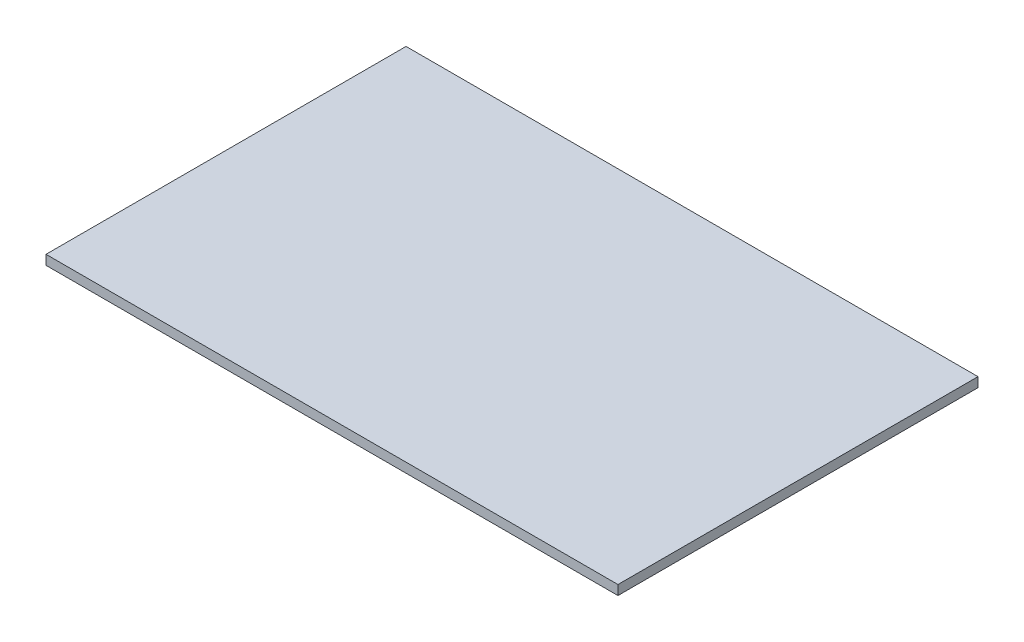
ISO-10303-21;
HEADER;
FILE_DESCRIPTION(('STEP AP214'),'2;1');
FILE_NAME('part.step','',(''),(''),'','','');
FILE_SCHEMA(('AUTOMOTIVE_DESIGN { 1 0 10303 214 1 1 1 1 }'));
ENDSEC;
DATA;
#1=APPLICATION_CONTEXT('core data for automotive mechanical design processes');
#2=APPLICATION_PROTOCOL_DEFINITION('international standard','automotive_design',2000,#1);
#3=PRODUCT_CONTEXT('',#1,'mechanical');
#4=PRODUCT('Part','Part','',(#3));
#5=PRODUCT_RELATED_PRODUCT_CATEGORY('part','',(#4));
#6=PRODUCT_DEFINITION_FORMATION('','',#4);
#7=PRODUCT_DEFINITION_CONTEXT('part definition',#1,'design');
#8=PRODUCT_DEFINITION('design','',#6,#7);
#9=PRODUCT_DEFINITION_SHAPE('','',#8);
#10=(LENGTH_UNIT() NAMED_UNIT(*) SI_UNIT(.MILLI.,.METRE.));
#11=(NAMED_UNIT(*) PLANE_ANGLE_UNIT() SI_UNIT($,.RADIAN.));
#12=(NAMED_UNIT(*) SI_UNIT($,.STERADIAN.) SOLID_ANGLE_UNIT());
#13=UNCERTAINTY_MEASURE_WITH_UNIT(LENGTH_MEASURE(1.E-05),#10,'distance_accuracy_value','');
#14=(GEOMETRIC_REPRESENTATION_CONTEXT(3) GLOBAL_UNCERTAINTY_ASSIGNED_CONTEXT((#13)) GLOBAL_UNIT_ASSIGNED_CONTEXT((#10,
#11,#12)) REPRESENTATION_CONTEXT('',''));
#15=CARTESIAN_POINT('',(0.,0.,0.));
#16=DIRECTION('',(0.,0.,1.));
#17=DIRECTION('',(1.,0.,0.));
#18=AXIS2_PLACEMENT_3D('',#15,#16,#17);
#19=CARTESIAN_POINT('',(895.,30.,563.4));
#20=DIRECTION('',(-1.,0.,0.));
#21=DIRECTION('',(0.,0.,1.));
#22=AXIS2_PLACEMENT_3D('',#19,#20,#21);
#23=PLANE('',#22);
#24=DIRECTION('',(0.,0.,-1.));
#25=VECTOR('',#24,1.);
#26=CARTESIAN_POINT('',(895.,0.,563.4));
#27=LINE('',#26,#25);
#28=CARTESIAN_POINT('',(895.,0.,563.4));
#29=VERTEX_POINT('',#28);
#30=CARTESIAN_POINT('',(895.,0.,-563.4));
#31=VERTEX_POINT('',#30);
#32=EDGE_CURVE('E96',#29,#31,#27,.T.);
#33=ORIENTED_EDGE('',*,*,#32,.T.);
#34=DIRECTION('',(0.,-1.,0.));
#35=VECTOR('',#34,1.);
#36=CARTESIAN_POINT('',(895.,30.,-563.4));
#37=LINE('',#36,#35);
#38=CARTESIAN_POINT('',(895.,30.,-563.4));
#39=VERTEX_POINT('',#38);
#40=EDGE_CURVE('E11',#39,#31,#37,.T.);
#41=ORIENTED_EDGE('',*,*,#40,.F.);
#42=DIRECTION('',(0.,0.,-1.));
#43=VECTOR('',#42,1.);
#44=CARTESIAN_POINT('',(895.,30.,563.4));
#45=LINE('',#44,#43);
#46=CARTESIAN_POINT('',(895.,30.,563.4));
#47=VERTEX_POINT('',#46);
#48=EDGE_CURVE('E84',#47,#39,#45,.T.);
#49=ORIENTED_EDGE('',*,*,#48,.F.);
#50=DIRECTION('',(0.,-1.,0.));
#51=VECTOR('',#50,1.);
#52=CARTESIAN_POINT('',(895.,30.,563.4));
#53=LINE('',#52,#51);
#54=EDGE_CURVE('E92',#47,#29,#53,.T.);
#55=ORIENTED_EDGE('',*,*,#54,.T.);
#56=EDGE_LOOP('',(#33,#41,#49,#55));
#57=FACE_BOUND('',#56,.T.);
#58=ADVANCED_FACE('F33',(#57),#23,.F.);
#59=CARTESIAN_POINT('',(-895.,30.,-563.4));
#60=DIRECTION('',(0.,0.,1.));
#61=DIRECTION('',(1.,0.,0.));
#62=AXIS2_PLACEMENT_3D('',#59,#60,#61);
#63=PLANE('',#62);
#64=DIRECTION('',(-1.,0.,0.));
#65=VECTOR('',#64,1.);
#66=CARTESIAN_POINT('',(-895.,0.,-563.4));
#67=LINE('',#66,#65);
#68=CARTESIAN_POINT('',(-895.,0.,-563.4));
#69=VERTEX_POINT('',#68);
#70=EDGE_CURVE('E88',#31,#69,#67,.T.);
#71=ORIENTED_EDGE('',*,*,#70,.T.);
#72=DIRECTION('',(0.,-1.,0.));
#73=VECTOR('',#72,1.);
#74=CARTESIAN_POINT('',(-895.,30.,-563.4));
#75=LINE('',#74,#73);
#76=CARTESIAN_POINT('',(-895.,30.,-563.4));
#77=VERTEX_POINT('',#76);
#78=EDGE_CURVE('E41',#77,#69,#75,.T.);
#79=ORIENTED_EDGE('',*,*,#78,.F.);
#80=DIRECTION('',(-1.,0.,0.));
#81=VECTOR('',#80,1.);
#82=CARTESIAN_POINT('',(-895.,30.,-563.4));
#83=LINE('',#82,#81);
#84=EDGE_CURVE('E79',#39,#77,#83,.T.);
#85=ORIENTED_EDGE('',*,*,#84,.F.);
#86=ORIENTED_EDGE('',*,*,#40,.T.);
#87=EDGE_LOOP('',(#71,#79,#85,#86));
#88=FACE_BOUND('',#87,.T.);
#89=ADVANCED_FACE('F87',(#88),#63,.F.);
#90=CARTESIAN_POINT('',(-895.,30.,563.4));
#91=DIRECTION('',(1.,0.,0.));
#92=DIRECTION('',(0.,0.,-1.));
#93=AXIS2_PLACEMENT_3D('',#90,#91,#92);
#94=PLANE('',#93);
#95=DIRECTION('',(0.,0.,1.));
#96=VECTOR('',#95,1.);
#97=CARTESIAN_POINT('',(-895.,0.,563.4));
#98=LINE('',#97,#96);
#99=CARTESIAN_POINT('',(-895.,0.,563.4));
#100=VERTEX_POINT('',#99);
#101=EDGE_CURVE('E66',#69,#100,#98,.T.);
#102=ORIENTED_EDGE('',*,*,#101,.T.);
#103=DIRECTION('',(0.,-1.,0.));
#104=VECTOR('',#103,1.);
#105=CARTESIAN_POINT('',(-895.,30.,563.4));
#106=LINE('',#105,#104);
#107=CARTESIAN_POINT('',(-895.,30.,563.4));
#108=VERTEX_POINT('',#107);
#109=EDGE_CURVE('E89',#108,#100,#106,.T.);
#110=ORIENTED_EDGE('',*,*,#109,.F.);
#111=DIRECTION('',(0.,0.,1.));
#112=VECTOR('',#111,1.);
#113=CARTESIAN_POINT('',(-895.,30.,563.4));
#114=LINE('',#113,#112);
#115=EDGE_CURVE('E82',#77,#108,#114,.T.);
#116=ORIENTED_EDGE('',*,*,#115,.F.);
#117=ORIENTED_EDGE('',*,*,#78,.T.);
#118=EDGE_LOOP('',(#102,#110,#116,#117));
#119=FACE_BOUND('',#118,.T.);
#120=ADVANCED_FACE('F90',(#119),#94,.F.);
#121=CARTESIAN_POINT('',(-895.,30.,563.4));
#122=DIRECTION('',(0.,0.,-1.));
#123=DIRECTION('',(-1.,0.,0.));
#124=AXIS2_PLACEMENT_3D('',#121,#122,#123);
#125=PLANE('',#124);
#126=DIRECTION('',(1.,0.,0.));
#127=VECTOR('',#126,1.);
#128=CARTESIAN_POINT('',(-895.,0.,563.4));
#129=LINE('',#128,#127);
#130=EDGE_CURVE('E72',#100,#29,#129,.T.);
#131=ORIENTED_EDGE('',*,*,#130,.T.);
#132=ORIENTED_EDGE('',*,*,#54,.F.);
#133=DIRECTION('',(1.,0.,0.));
#134=VECTOR('',#133,1.);
#135=CARTESIAN_POINT('',(-895.,30.,563.4));
#136=LINE('',#135,#134);
#137=EDGE_CURVE('E49',#108,#47,#136,.T.);
#138=ORIENTED_EDGE('',*,*,#137,.F.);
#139=ORIENTED_EDGE('',*,*,#109,.T.);
#140=EDGE_LOOP('',(#131,#132,#138,#139));
#141=FACE_BOUND('',#140,.T.);
#142=ADVANCED_FACE('F103',(#141),#125,.F.);
#143=CARTESIAN_POINT('',(0.,30.,0.));
#144=DIRECTION('',(0.,-1.,0.));
#145=DIRECTION('',(0.,0.,-1.));
#146=AXIS2_PLACEMENT_3D('',#143,#144,#145);
#147=PLANE('',#146);
#148=ORIENTED_EDGE('',*,*,#48,.T.);
#149=ORIENTED_EDGE('',*,*,#84,.T.);
#150=ORIENTED_EDGE('',*,*,#115,.T.);
#151=ORIENTED_EDGE('',*,*,#137,.T.);
#152=EDGE_LOOP('',(#148,#149,#150,#151));
#153=FACE_BOUND('',#152,.T.);
#154=ADVANCED_FACE('F80',(#153),#147,.F.);
#155=CARTESIAN_POINT('',(0.,0.,0.));
#156=DIRECTION('',(0.,-1.,0.));
#157=DIRECTION('',(0.,0.,-1.));
#158=AXIS2_PLACEMENT_3D('',#155,#156,#157);
#159=PLANE('',#158);
#160=ORIENTED_EDGE('',*,*,#32,.F.);
#161=ORIENTED_EDGE('',*,*,#130,.F.);
#162=ORIENTED_EDGE('',*,*,#101,.F.);
#163=ORIENTED_EDGE('',*,*,#70,.F.);
#164=EDGE_LOOP('',(#160,#161,#162,#163));
#165=FACE_BOUND('',#164,.T.);
#166=ADVANCED_FACE('F106',(#165),#159,.T.);
#167=CLOSED_SHELL('',(#58,#89,#120,#142,#154,#166));
#168=MANIFOLD_SOLID_BREP('B2',#167);
#169=ADVANCED_BREP_SHAPE_REPRESENTATION('',(#18,#168),#14);
#170=SHAPE_DEFINITION_REPRESENTATION(#9,#169);
ENDSEC;
END-ISO-10303-21;
